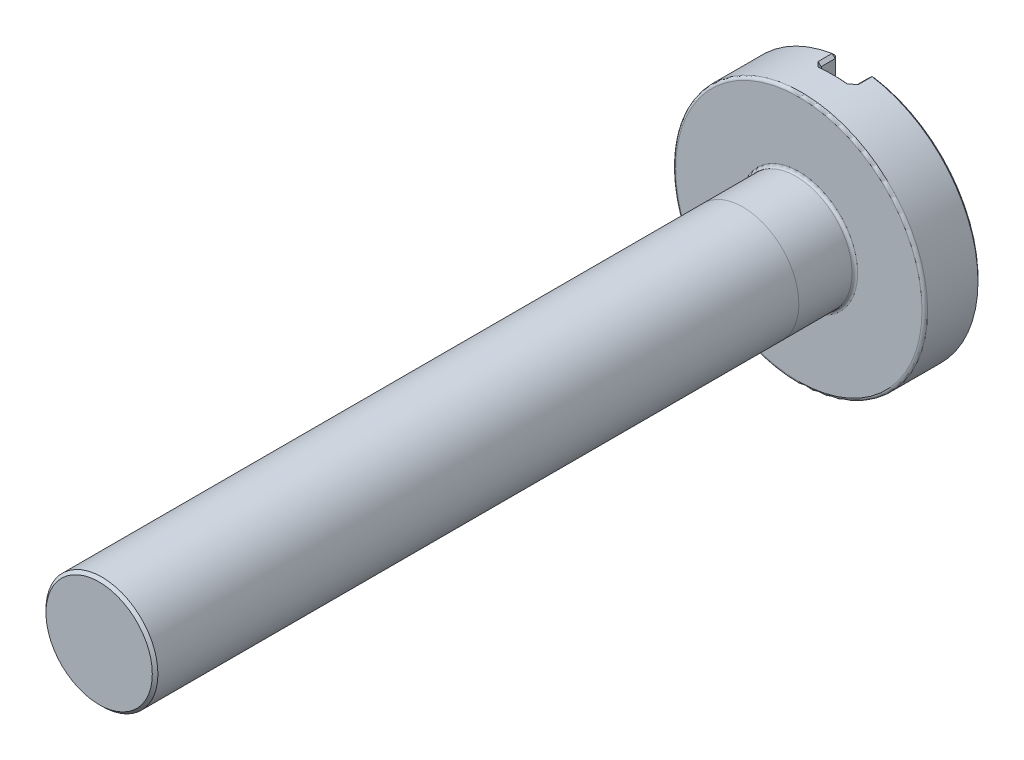
ISO-10303-21;
HEADER;
FILE_DESCRIPTION(('STEP AP214'),'2;1');
FILE_NAME('part.step','',(''),(''),'','','');
FILE_SCHEMA(('AUTOMOTIVE_DESIGN { 1 0 10303 214 1 1 1 1 }'));
ENDSEC;
DATA;
#1=APPLICATION_CONTEXT('core data for automotive mechanical design processes');
#2=APPLICATION_PROTOCOL_DEFINITION('international standard','automotive_design',2000,#1);
#3=PRODUCT_CONTEXT('',#1,'mechanical');
#4=PRODUCT('Part','Part','',(#3));
#5=PRODUCT_RELATED_PRODUCT_CATEGORY('part','',(#4));
#6=PRODUCT_DEFINITION_FORMATION('','',#4);
#7=PRODUCT_DEFINITION_CONTEXT('part definition',#1,'design');
#8=PRODUCT_DEFINITION('design','',#6,#7);
#9=PRODUCT_DEFINITION_SHAPE('','',#8);
#10=(LENGTH_UNIT() NAMED_UNIT(*) SI_UNIT(.MILLI.,.METRE.));
#11=(NAMED_UNIT(*) PLANE_ANGLE_UNIT() SI_UNIT($,.RADIAN.));
#12=(NAMED_UNIT(*) SI_UNIT($,.STERADIAN.) SOLID_ANGLE_UNIT());
#13=UNCERTAINTY_MEASURE_WITH_UNIT(LENGTH_MEASURE(1.E-05),#10,'distance_accuracy_value','');
#14=(GEOMETRIC_REPRESENTATION_CONTEXT(3) GLOBAL_UNCERTAINTY_ASSIGNED_CONTEXT((#13)) GLOBAL_UNIT_ASSIGNED_CONTEXT((#10,
#11,#12)) REPRESENTATION_CONTEXT('',''));
#15=CARTESIAN_POINT('',(0.,0.,0.));
#16=DIRECTION('',(0.,0.,1.));
#17=DIRECTION('',(1.,0.,0.));
#18=AXIS2_PLACEMENT_3D('',#15,#16,#17);
#19=CARTESIAN_POINT('',(0.,0.,12.5));
#20=DIRECTION('',(0.,0.,-1.));
#21=DIRECTION('',(-1.,0.,0.));
#22=AXIS2_PLACEMENT_3D('',#19,#20,#21);
#23=CYLINDRICAL_SURFACE('',#22,1.);
#24=CARTESIAN_POINT('',(0.,0.,12.45));
#25=DIRECTION('',(0.,0.,1.));
#26=DIRECTION('',(1.,0.,0.));
#27=AXIS2_PLACEMENT_3D('',#24,#25,#26);
#28=CIRCLE('',#27,1.);
#29=CARTESIAN_POINT('',(1.,0.,12.45));
#30=VERTEX_POINT('',#29);
#31=EDGE_CURVE('E46',#30,#30,#28,.F.);
#32=ORIENTED_EDGE('',*,*,#31,.T.);
#33=EDGE_LOOP('',(#32));
#34=FACE_BOUND('',#33,.T.);
#35=CARTESIAN_POINT('',(0.,0.,1.));
#36=DIRECTION('',(0.,0.,-1.));
#37=DIRECTION('',(0.,1.,0.));
#38=AXIS2_PLACEMENT_3D('',#35,#36,#37);
#39=CIRCLE('',#38,1.);
#40=CARTESIAN_POINT('',(0.,1.,1.));
#41=VERTEX_POINT('',#40);
#42=EDGE_CURVE('E11',#41,#41,#39,.T.);
#43=ORIENTED_EDGE('',*,*,#42,.F.);
#44=EDGE_LOOP('',(#43));
#45=FACE_BOUND('',#44,.T.);
#46=ADVANCED_FACE('F37',(#34,#45),#23,.T.);
#47=CARTESIAN_POINT('',(0.,0.,-1.));
#48=DIRECTION('',(0.,0.,1.));
#49=DIRECTION('',(1.,0.,0.));
#50=AXIS2_PLACEMENT_3D('',#47,#48,#49);
#51=CYLINDRICAL_SURFACE('',#50,2.25);
#52=CARTESIAN_POINT('',(0.,0.,-0.05));
#53=DIRECTION('',(0.,0.,1.));
#54=DIRECTION('',(1.,0.,0.));
#55=AXIS2_PLACEMENT_3D('',#52,#53,#54);
#56=CIRCLE('',#55,2.25);
#57=CARTESIAN_POINT('',(2.25,0.,-0.05));
#58=VERTEX_POINT('',#57);
#59=EDGE_CURVE('E461',#58,#58,#56,.F.);
#60=ORIENTED_EDGE('',*,*,#59,.T.);
#61=EDGE_LOOP('',(#60));
#62=FACE_BOUND('',#61,.T.);
#63=CARTESIAN_POINT('',(-0.357954545454545,2.22134385978138,-0.7));
#64=CARTESIAN_POINT('',(-0.349044313577281,2.22277959220945,-0.691081725524456));
#65=CARTESIAN_POINT('',(-0.340106008970926,2.22416500607063,-0.682183310951015));
#66=CARTESIAN_POINT('',(-0.322168315908917,2.22683406364462,-0.66443290328283));
#67=CARTESIAN_POINT('',(-0.313168927393423,2.2281177072577,-0.655580910233578));
#68=CARTESIAN_POINT('',(-0.288093679970526,2.2315384498966,-0.631080236997653));
#69=CARTESIAN_POINT('',(-0.271946710820839,2.23356468320811,-0.615488807873462));
#70=CARTESIAN_POINT('',(-0.255681818186013,2.23542541988267,-0.600000000002842));
#71=B_SPLINE_CURVE_WITH_KNOTS('',3,(#63,#64,#65,#66,#67,#68,#69,#70),.UNSPECIFIED.,.F.,.F.,(4,2,
2,4),(0.,0.0380643972705644,0.0761288318363078,0.143736873551843),.UNSPECIFIED.);
#72=CARTESIAN_POINT('',(-0.357954545454545,2.22134385978138,-0.7));
#73=VERTEX_POINT('',#72);
#74=CARTESIAN_POINT('',(-0.255681818181818,2.23542541988124,-0.6));
#75=VERTEX_POINT('',#74);
#76=EDGE_CURVE('E250',#73,#75,#71,.T.);
#77=ORIENTED_EDGE('',*,*,#76,.F.);
#78=DIRECTION('',(0.,0.,1.));
#79=VECTOR('',#78,1.);
#80=CARTESIAN_POINT('',(-0.357954545454545,2.22134385978138,-1.));
#81=LINE('',#80,#79);
#82=CARTESIAN_POINT('',(-0.357954545454545,2.22134385978138,-0.95));
#83=VERTEX_POINT('',#82);
#84=EDGE_CURVE('E248',#73,#83,#81,.F.);
#85=ORIENTED_EDGE('',*,*,#84,.T.);
#86=CARTESIAN_POINT('',(0.,0.,-0.95));
#87=DIRECTION('',(0.,0.,1.));
#88=DIRECTION('',(1.,0.,0.));
#89=AXIS2_PLACEMENT_3D('',#86,#87,#88);
#90=CIRCLE('',#89,2.25);
#91=CARTESIAN_POINT('',(-0.357954545454546,-2.22134385978138,-0.95));
#92=VERTEX_POINT('',#91);
#93=EDGE_CURVE('E243',#83,#92,#90,.T.);
#94=ORIENTED_EDGE('',*,*,#93,.T.);
#95=DIRECTION('',(0.,0.,1.));
#96=VECTOR('',#95,1.);
#97=CARTESIAN_POINT('',(-0.357954545454546,-2.22134385978138,-1.));
#98=LINE('',#97,#96);
#99=CARTESIAN_POINT('',(-0.357954545454546,-2.22134385978138,-0.7));
#100=VERTEX_POINT('',#99);
#101=EDGE_CURVE('E241',#92,#100,#98,.T.);
#102=ORIENTED_EDGE('',*,*,#101,.T.);
#103=CARTESIAN_POINT('',(-0.255681818181819,-2.23542541988124,-0.6));
#104=CARTESIAN_POINT('',(-0.264839427943543,-2.23437790052861,-0.608719796943995));
#105=CARTESIAN_POINT('',(-0.273959417330191,-2.23327784719118,-0.617472569925155));
#106=CARTESIAN_POINT('',(-0.292129371731721,-2.23097387990717,-0.635036917762393));
#107=CARTESIAN_POINT('',(-0.301179336862999,-2.22976996613328,-0.643848492520682));
#108=CARTESIAN_POINT('',(-0.326213414850238,-2.22628523492307,-0.668382417252335));
#109=CARTESIAN_POINT('',(-0.342127740146841,-2.22389382114136,-0.684160444997389));
#110=CARTESIAN_POINT('',(-0.357954545456662,-2.22134385978236,-0.700000000001358));
#111=B_SPLINE_CURVE_WITH_KNOTS('',3,(#103,#104,#105,#106,#107,#108,#109,#110),.UNSPECIFIED.,.F.,
.F.,(4,2,2,4),(0.,0.0380645508803726,0.0761290384749273,0.143736997088426),.UNSPECIFIED.);
#112=CARTESIAN_POINT('',(-0.255681818181819,-2.23542541988124,-0.6));
#113=VERTEX_POINT('',#112);
#114=EDGE_CURVE('E234',#113,#100,#111,.T.);
#115=ORIENTED_EDGE('',*,*,#114,.F.);
#116=CARTESIAN_POINT('',(0.,0.,-0.6));
#117=DIRECTION('',(0.,0.,-1.));
#118=DIRECTION('',(-1.,0.,0.));
#119=AXIS2_PLACEMENT_3D('',#116,#117,#118);
#120=CIRCLE('',#119,2.25);
#121=CARTESIAN_POINT('',(0.255681818181818,-2.23542541988125,-0.6));
#122=VERTEX_POINT('',#121);
#123=EDGE_CURVE('E197',#113,#122,#120,.F.);
#124=ORIENTED_EDGE('',*,*,#123,.T.);
#125=CARTESIAN_POINT('',(0.357954545454544,-2.22134385978138,-0.7));
#126=CARTESIAN_POINT('',(0.34904431357728,-2.22277959220945,-0.691081725524455));
#127=CARTESIAN_POINT('',(0.340106008970925,-2.22416500607064,-0.682183310951015));
#128=CARTESIAN_POINT('',(0.322168315908916,-2.22683406364462,-0.66443290328283));
#129=CARTESIAN_POINT('',(0.313168927393421,-2.2281177072577,-0.655580910233578));
#130=CARTESIAN_POINT('',(0.288093679970524,-2.2315384498966,-0.631080236997653));
#131=CARTESIAN_POINT('',(0.271946710820837,-2.2335646832081,-0.615488807873463));
#132=CARTESIAN_POINT('',(0.255681818186012,-2.23542541988267,-0.600000000002842));
#133=B_SPLINE_CURVE_WITH_KNOTS('',3,(#125,#126,#127,#128,#129,#130,#131,#132),.UNSPECIFIED.,.F.,
.F.,(4,2,2,4),(0.,0.0380643972705647,0.0761288318363081,0.143736873551843),.UNSPECIFIED.);
#134=CARTESIAN_POINT('',(0.357954545454544,-2.22134385978138,-0.7));
#135=VERTEX_POINT('',#134);
#136=EDGE_CURVE('E188',#135,#122,#133,.T.);
#137=ORIENTED_EDGE('',*,*,#136,.F.);
#138=DIRECTION('',(0.,0.,1.));
#139=VECTOR('',#138,1.);
#140=CARTESIAN_POINT('',(0.357954545454544,-2.22134385978138,-1.));
#141=LINE('',#140,#139);
#142=CARTESIAN_POINT('',(0.357954545454544,-2.22134385978138,-0.95));
#143=VERTEX_POINT('',#142);
#144=EDGE_CURVE('E186',#135,#143,#141,.F.);
#145=ORIENTED_EDGE('',*,*,#144,.T.);
#146=CARTESIAN_POINT('',(0.,0.,-0.95));
#147=DIRECTION('',(0.,0.,1.));
#148=DIRECTION('',(1.,0.,0.));
#149=AXIS2_PLACEMENT_3D('',#146,#147,#148);
#150=CIRCLE('',#149,2.25);
#151=CARTESIAN_POINT('',(0.357954545454545,2.22134385978138,-0.95));
#152=VERTEX_POINT('',#151);
#153=EDGE_CURVE('E182',#143,#152,#150,.T.);
#154=ORIENTED_EDGE('',*,*,#153,.T.);
#155=DIRECTION('',(0.,0.,1.));
#156=VECTOR('',#155,1.);
#157=CARTESIAN_POINT('',(0.357954545454545,2.22134385978138,-1.));
#158=LINE('',#157,#156);
#159=CARTESIAN_POINT('',(0.357954545454545,2.22134385978138,-0.7));
#160=VERTEX_POINT('',#159);
#161=EDGE_CURVE('E184',#152,#160,#158,.T.);
#162=ORIENTED_EDGE('',*,*,#161,.T.);
#163=CARTESIAN_POINT('',(0.255681818181818,2.23542541988124,-0.6));
#164=CARTESIAN_POINT('',(0.264839427943543,2.23437790052862,-0.608719796943994));
#165=CARTESIAN_POINT('',(0.273959417330191,2.23327784719118,-0.617472569925155));
#166=CARTESIAN_POINT('',(0.29212937173172,2.23097387990717,-0.635036917762392));
#167=CARTESIAN_POINT('',(0.301179336862998,2.22976996613328,-0.643848492520682));
#168=CARTESIAN_POINT('',(0.326213414850236,2.22628523492307,-0.668382417252336));
#169=CARTESIAN_POINT('',(0.342127740146839,2.22389382114135,-0.68416044499739));
#170=CARTESIAN_POINT('',(0.357954545456661,2.22134385978236,-0.700000000001358));
#171=B_SPLINE_CURVE_WITH_KNOTS('',3,(#163,#164,#165,#166,#167,#168,#169,#170),.UNSPECIFIED.,.F.,
.F.,(4,2,2,4),(0.,0.0380645508803723,0.0761290384749269,0.143736997088426),.UNSPECIFIED.);
#172=CARTESIAN_POINT('',(0.255681818181818,2.23542541988124,-0.6));
#173=VERTEX_POINT('',#172);
#174=EDGE_CURVE('E227',#173,#160,#171,.T.);
#175=ORIENTED_EDGE('',*,*,#174,.F.);
#176=CARTESIAN_POINT('',(0.,0.,-0.6));
#177=DIRECTION('',(0.,0.,-1.));
#178=DIRECTION('',(-1.,0.,0.));
#179=AXIS2_PLACEMENT_3D('',#176,#177,#178);
#180=CIRCLE('',#179,2.25);
#181=EDGE_CURVE('E246',#173,#75,#180,.F.);
#182=ORIENTED_EDGE('',*,*,#181,.T.);
#183=EDGE_LOOP('',(#77,#85,#94,#102,#115,#124,#137,#145,#154,#162,#175,#182));
#184=FACE_BOUND('',#183,.T.);
#185=ADVANCED_FACE('F199',(#62,#184),#51,.T.);
#186=CARTESIAN_POINT('',(0.,0.,-1.));
#187=DIRECTION('',(0.,0.,1.));
#188=DIRECTION('',(1.,0.,0.));
#189=AXIS2_PLACEMENT_3D('',#186,#187,#188);
#190=PLANE('',#189);
#191=CARTESIAN_POINT('',(0.,0.,-1.));
#192=DIRECTION('',(0.,0.,1.));
#193=DIRECTION('',(1.,0.,0.));
#194=AXIS2_PLACEMENT_3D('',#191,#192,#193);
#195=CIRCLE('',#194,2.2);
#196=CARTESIAN_POINT('',(-0.35,-2.17198066289735,-1.));
#197=VERTEX_POINT('',#196);
#198=CARTESIAN_POINT('',(-0.35,2.17198066289735,-1.));
#199=VERTEX_POINT('',#198);
#200=EDGE_CURVE('E165',#197,#199,#195,.F.);
#201=ORIENTED_EDGE('',*,*,#200,.T.);
#202=DIRECTION('',(0.,-1.,0.));
#203=VECTOR('',#202,1.);
#204=CARTESIAN_POINT('',(-0.35,0.,-1.));
#205=LINE('',#204,#203);
#206=EDGE_CURVE('E147',#199,#197,#205,.T.);
#207=ORIENTED_EDGE('',*,*,#206,.T.);
#208=EDGE_LOOP('',(#201,#207));
#209=FACE_BOUND('',#208,.T.);
#210=ADVANCED_FACE('F172',(#209),#190,.F.);
#211=ORIENTED_EDGE('',*,*,#42,.T.);
#212=EDGE_LOOP('',(#211));
#213=FACE_BOUND('',#212,.T.);
#214=CARTESIAN_POINT('',(0.,0.,0.0499999999999997));
#215=DIRECTION('',(0.,0.,1.));
#216=DIRECTION('',(1.,0.,0.));
#217=AXIS2_PLACEMENT_3D('',#214,#215,#216);
#218=CIRCLE('',#217,1.);
#219=CARTESIAN_POINT('',(1.,0.,0.0499999999999997));
#220=VERTEX_POINT('',#219);
#221=EDGE_CURVE('E459',#220,#220,#218,.T.);
#222=ORIENTED_EDGE('',*,*,#221,.T.);
#223=EDGE_LOOP('',(#222));
#224=FACE_BOUND('',#223,.T.);
#225=ADVANCED_FACE('F208',(#213,#224),#23,.T.);
#226=CARTESIAN_POINT('',(0.,0.,12.5));
#227=DIRECTION('',(0.,0.,1.));
#228=DIRECTION('',(1.,0.,0.));
#229=AXIS2_PLACEMENT_3D('',#226,#227,#228);
#230=PLANE('',#229);
#231=CARTESIAN_POINT('',(0.,0.,12.5));
#232=DIRECTION('',(0.,0.,1.));
#233=DIRECTION('',(1.,0.,0.));
#234=AXIS2_PLACEMENT_3D('',#231,#232,#233);
#235=CIRCLE('',#234,0.950000000000003);
#236=CARTESIAN_POINT('',(0.950000000000003,0.,12.5));
#237=VERTEX_POINT('',#236);
#238=EDGE_CURVE('E460',#237,#237,#235,.T.);
#239=ORIENTED_EDGE('',*,*,#238,.T.);
#240=EDGE_LOOP('',(#239));
#241=FACE_BOUND('',#240,.T.);
#242=ADVANCED_FACE('F446',(#241),#230,.T.);
#243=CARTESIAN_POINT('',(0.,0.,-1.));
#244=DIRECTION('',(0.,0.,1.));
#245=DIRECTION('',(1.,0.,0.));
#246=AXIS2_PLACEMENT_3D('',#243,#244,#245);
#247=CIRCLE('',#246,2.2);
#248=CARTESIAN_POINT('',(0.35,2.17198066289735,-1.));
#249=VERTEX_POINT('',#248);
#250=CARTESIAN_POINT('',(0.349999999999999,-2.17198066289735,-1.));
#251=VERTEX_POINT('',#250);
#252=EDGE_CURVE('E52',#249,#251,#247,.F.);
#253=ORIENTED_EDGE('',*,*,#252,.T.);
#254=DIRECTION('',(0.,1.,0.));
#255=VECTOR('',#254,1.);
#256=CARTESIAN_POINT('',(0.349999999999999,0.,-1.));
#257=LINE('',#256,#255);
#258=EDGE_CURVE('E477',#251,#249,#257,.T.);
#259=ORIENTED_EDGE('',*,*,#258,.T.);
#260=EDGE_LOOP('',(#253,#259));
#261=FACE_BOUND('',#260,.T.);
#262=ADVANCED_FACE('F452',(#261),#190,.F.);
#263=CARTESIAN_POINT('',(0.,0.,0.));
#264=DIRECTION('',(0.,0.,1.));
#265=DIRECTION('',(1.,0.,0.));
#266=AXIS2_PLACEMENT_3D('',#263,#264,#265);
#267=PLANE('',#266);
#268=CARTESIAN_POINT('',(0.,0.,0.));
#269=DIRECTION('',(0.,0.,1.));
#270=DIRECTION('',(1.,0.,0.));
#271=AXIS2_PLACEMENT_3D('',#268,#269,#270);
#272=CIRCLE('',#271,2.2);
#273=CARTESIAN_POINT('',(2.2,0.,0.));
#274=VERTEX_POINT('',#273);
#275=EDGE_CURVE('E466',#274,#274,#272,.T.);
#276=ORIENTED_EDGE('',*,*,#275,.T.);
#277=EDGE_LOOP('',(#276));
#278=FACE_BOUND('',#277,.T.);
#279=CARTESIAN_POINT('',(0.,0.,0.));
#280=DIRECTION('',(0.,0.,1.));
#281=DIRECTION('',(1.,0.,0.));
#282=AXIS2_PLACEMENT_3D('',#279,#280,#281);
#283=CIRCLE('',#282,1.05);
#284=CARTESIAN_POINT('',(1.05,0.,0.));
#285=VERTEX_POINT('',#284);
#286=EDGE_CURVE('E474',#285,#285,#283,.F.);
#287=ORIENTED_EDGE('',*,*,#286,.T.);
#288=EDGE_LOOP('',(#287));
#289=FACE_BOUND('',#288,.T.);
#290=ADVANCED_FACE('F604',(#278,#289),#267,.T.);
#291=CARTESIAN_POINT('',(-0.299999999999999,11.0409396780184,-0.65));
#292=DIRECTION('',(-1.,0.,0.));
#293=DIRECTION('',(0.,-1.,0.));
#294=AXIS2_PLACEMENT_3D('',#291,#292,#293);
#295=PLANE('',#294);
#296=DIRECTION('',(0.,0.,-1.));
#297=VECTOR('',#296,1.);
#298=CARTESIAN_POINT('',(-0.300000000000001,-2.17198066289735,-1.));
#299=LINE('',#298,#297);
#300=CARTESIAN_POINT('',(-0.300000000000001,-2.17198066289735,-0.7));
#301=VERTEX_POINT('',#300);
#302=CARTESIAN_POINT('',(-0.300000000000001,-2.17198066289735,-0.95));
#303=VERTEX_POINT('',#302);
#304=EDGE_CURVE('E179',#301,#303,#299,.T.);
#305=ORIENTED_EDGE('',*,*,#304,.T.);
#306=DIRECTION('',(0.,1.,0.));
#307=VECTOR('',#306,1.);
#308=CARTESIAN_POINT('',(-0.299999999999999,11.0409396780184,-0.95));
#309=LINE('',#308,#307);
#310=CARTESIAN_POINT('',(-0.3,2.17198066289735,-0.95));
#311=VERTEX_POINT('',#310);
#312=EDGE_CURVE('E149',#303,#311,#309,.T.);
#313=ORIENTED_EDGE('',*,*,#312,.T.);
#314=DIRECTION('',(0.,0.,1.));
#315=VECTOR('',#314,1.);
#316=CARTESIAN_POINT('',(-0.3,2.17198066289735,-0.65));
#317=LINE('',#316,#315);
#318=CARTESIAN_POINT('',(-0.3,2.17198066289735,-0.7));
#319=VERTEX_POINT('',#318);
#320=EDGE_CURVE('E175',#311,#319,#317,.T.);
#321=ORIENTED_EDGE('',*,*,#320,.T.);
#322=DIRECTION('',(0.,-1.,0.));
#323=VECTOR('',#322,1.);
#324=CARTESIAN_POINT('',(-0.299999999999999,11.0409396780184,-0.7));
#325=LINE('',#324,#323);
#326=EDGE_CURVE('E173',#319,#301,#325,.T.);
#327=ORIENTED_EDGE('',*,*,#326,.T.);
#328=EDGE_LOOP('',(#305,#313,#321,#327));
#329=FACE_BOUND('',#328,.T.);
#330=ADVANCED_FACE('F560',(#329),#295,.F.);
#331=CARTESIAN_POINT('',(0.300000000000001,11.0409396780184,-0.65));
#332=DIRECTION('',(1.,0.,0.));
#333=DIRECTION('',(0.,1.,0.));
#334=AXIS2_PLACEMENT_3D('',#331,#332,#333);
#335=PLANE('',#334);
#336=DIRECTION('',(0.,0.,1.));
#337=VECTOR('',#336,1.);
#338=CARTESIAN_POINT('',(0.299999999999999,-2.17198066289735,-0.65));
#339=LINE('',#338,#337);
#340=CARTESIAN_POINT('',(0.299999999999999,-2.17198066289735,-0.95));
#341=VERTEX_POINT('',#340);
#342=CARTESIAN_POINT('',(0.299999999999999,-2.17198066289735,-0.7));
#343=VERTEX_POINT('',#342);
#344=EDGE_CURVE('E496',#341,#343,#339,.T.);
#345=ORIENTED_EDGE('',*,*,#344,.T.);
#346=DIRECTION('',(0.,1.,0.));
#347=VECTOR('',#346,1.);
#348=CARTESIAN_POINT('',(0.300000000000001,11.0409396780184,-0.7));
#349=LINE('',#348,#347);
#350=CARTESIAN_POINT('',(0.3,2.17198066289735,-0.7));
#351=VERTEX_POINT('',#350);
#352=EDGE_CURVE('E525',#343,#351,#349,.T.);
#353=ORIENTED_EDGE('',*,*,#352,.T.);
#354=DIRECTION('',(0.,0.,-1.));
#355=VECTOR('',#354,1.);
#356=CARTESIAN_POINT('',(0.3,2.17198066289735,-1.));
#357=LINE('',#356,#355);
#358=CARTESIAN_POINT('',(0.3,2.17198066289735,-0.95));
#359=VERTEX_POINT('',#358);
#360=EDGE_CURVE('E520',#351,#359,#357,.T.);
#361=ORIENTED_EDGE('',*,*,#360,.T.);
#362=DIRECTION('',(0.,-1.,0.));
#363=VECTOR('',#362,1.);
#364=CARTESIAN_POINT('',(0.300000000000001,11.0409396780184,-0.95));
#365=LINE('',#364,#363);
#366=EDGE_CURVE('E257',#359,#341,#365,.T.);
#367=ORIENTED_EDGE('',*,*,#366,.T.);
#368=EDGE_LOOP('',(#345,#353,#361,#367));
#369=FACE_BOUND('',#368,.T.);
#370=ADVANCED_FACE('F660',(#369),#335,.F.);
#371=CARTESIAN_POINT('',(0.,0.,-0.65));
#372=DIRECTION('',(0.,0.,-1.));
#373=DIRECTION('',(-1.,0.,0.));
#374=AXIS2_PLACEMENT_3D('',#371,#372,#373);
#375=PLANE('',#374);
#376=DIRECTION('',(0.,-1.,0.));
#377=VECTOR('',#376,1.);
#378=CARTESIAN_POINT('',(0.25,0.,-0.65));
#379=LINE('',#378,#377);
#380=CARTESIAN_POINT('',(0.25,2.18574929943944,-0.65));
#381=VERTEX_POINT('',#380);
#382=CARTESIAN_POINT('',(0.25,-2.18574929943944,-0.65));
#383=VERTEX_POINT('',#382);
#384=EDGE_CURVE('E526',#381,#383,#379,.T.);
#385=ORIENTED_EDGE('',*,*,#384,.T.);
#386=CARTESIAN_POINT('',(0.,0.,-0.65));
#387=DIRECTION('',(0.,0.,-1.));
#388=DIRECTION('',(-1.,0.,0.));
#389=AXIS2_PLACEMENT_3D('',#386,#387,#388);
#390=CIRCLE('',#389,2.2);
#391=CARTESIAN_POINT('',(-0.250000000000001,-2.18574929943944,-0.65));
#392=VERTEX_POINT('',#391);
#393=EDGE_CURVE('E511',#383,#392,#390,.T.);
#394=ORIENTED_EDGE('',*,*,#393,.T.);
#395=DIRECTION('',(0.,1.,0.));
#396=VECTOR('',#395,1.);
#397=CARTESIAN_POINT('',(-0.250000000000001,0.,-0.65));
#398=LINE('',#397,#396);
#399=CARTESIAN_POINT('',(-0.25,2.18574929943944,-0.65));
#400=VERTEX_POINT('',#399);
#401=EDGE_CURVE('E531',#392,#400,#398,.T.);
#402=ORIENTED_EDGE('',*,*,#401,.T.);
#403=CARTESIAN_POINT('',(0.,0.,-0.65));
#404=DIRECTION('',(0.,0.,-1.));
#405=DIRECTION('',(-1.,0.,0.));
#406=AXIS2_PLACEMENT_3D('',#403,#404,#405);
#407=CIRCLE('',#406,2.2);
#408=EDGE_CURVE('E528',#400,#381,#407,.T.);
#409=ORIENTED_EDGE('',*,*,#408,.T.);
#410=EDGE_LOOP('',(#385,#394,#402,#409));
#411=FACE_BOUND('',#410,.T.);
#412=ADVANCED_FACE('F424',(#411),#375,.T.);
#413=CARTESIAN_POINT('',(0.,0.,-0.95));
#414=DIRECTION('',(0.,0.,1.));
#415=DIRECTION('',(1.,0.,0.));
#416=AXIS2_PLACEMENT_3D('',#413,#414,#415);
#417=CONICAL_SURFACE('',#416,2.25,0.785398163397448);
#418=DIRECTION('',(0.112494260643317,-0.698101025154894,0.707106781186548));
#419=VECTOR('',#418,1.);
#420=CARTESIAN_POINT('',(0.,0.,-3.2));
#421=LINE('',#420,#419);
#422=EDGE_CURVE('E480',#251,#143,#421,.T.);
#423=ORIENTED_EDGE('',*,*,#422,.F.);
#424=ORIENTED_EDGE('',*,*,#252,.F.);
#425=DIRECTION('',(-0.112494260643311,-0.698101025154894,-0.707106781186547));
#426=VECTOR('',#425,1.);
#427=CARTESIAN_POINT('',(0.,0.,-3.2));
#428=LINE('',#427,#426);
#429=EDGE_CURVE('E60',#152,#249,#428,.T.);
#430=ORIENTED_EDGE('',*,*,#429,.F.);
#431=ORIENTED_EDGE('',*,*,#153,.F.);
#432=EDGE_LOOP('',(#423,#424,#430,#431));
#433=FACE_BOUND('',#432,.T.);
#434=ADVANCED_FACE('F420',(#433),#417,.T.);
#435=CARTESIAN_POINT('',(0.349999999999999,0.,-1.));
#436=DIRECTION('',(0.707106781186548,0.,0.707106781186548));
#437=DIRECTION('',(0.,1.,0.));
#438=AXIS2_PLACEMENT_3D('',#435,#436,#437);
#439=PLANE('',#438);
#440=DIRECTION('',(0.707106781186548,0.,-0.707106781186548));
#441=VECTOR('',#440,1.);
#442=CARTESIAN_POINT('',(0.3,2.17198066289735,-0.95));
#443=LINE('',#442,#441);
#444=EDGE_CURVE('E170',#249,#359,#443,.F.);
#445=ORIENTED_EDGE('',*,*,#444,.F.);
#446=ORIENTED_EDGE('',*,*,#258,.F.);
#447=DIRECTION('',(-0.707106781186548,0.,0.707106781186548));
#448=VECTOR('',#447,1.);
#449=CARTESIAN_POINT('',(0.328977272727272,-2.17198066289735,-0.978977272727273));
#450=LINE('',#449,#448);
#451=EDGE_CURVE('E483',#341,#251,#450,.F.);
#452=ORIENTED_EDGE('',*,*,#451,.F.);
#453=ORIENTED_EDGE('',*,*,#366,.F.);
#454=EDGE_LOOP('',(#445,#446,#452,#453));
#455=FACE_BOUND('',#454,.T.);
#456=ADVANCED_FACE('F417',(#455),#439,.F.);
#457=CARTESIAN_POINT('',(0.3,2.17198066289735,-0.95));
#458=DIRECTION('',(-0.544058820349415,0.638748776906852,-0.544058820349421));
#459=DIRECTION('',(0.,0.648424664440325,0.761278828383827));
#460=AXIS2_PLACEMENT_3D('',#457,#458,#459);
#461=PLANE('',#460);
#462=ORIENTED_EDGE('',*,*,#429,.T.);
#463=ORIENTED_EDGE('',*,*,#444,.T.);
#464=DIRECTION('',(0.76127882838383,0.648424664440322,0.));
#465=VECTOR('',#464,1.);
#466=CARTESIAN_POINT('',(0.3,2.17198066289735,-0.95));
#467=LINE('',#466,#465);
#468=EDGE_CURVE('E485',#152,#359,#467,.F.);
#469=ORIENTED_EDGE('',*,*,#468,.F.);
#470=EDGE_LOOP('',(#462,#463,#469));
#471=FACE_BOUND('',#470,.T.);
#472=ADVANCED_FACE('F413',(#471),#461,.T.);
#473=CARTESIAN_POINT('',(0.357954545454544,-2.22134385978138,-0.95));
#474=DIRECTION('',(-0.54405882034942,-0.638748776906853,-0.544058820349415));
#475=DIRECTION('',(0.761278828383827,-0.648424664440325,0.));
#476=AXIS2_PLACEMENT_3D('',#473,#474,#475);
#477=PLANE('',#476);
#478=ORIENTED_EDGE('',*,*,#451,.T.);
#479=ORIENTED_EDGE('',*,*,#422,.T.);
#480=DIRECTION('',(0.761278828383827,-0.648424664440325,0.));
#481=VECTOR('',#480,1.);
#482=CARTESIAN_POINT('',(0.357954545454544,-2.22134385978138,-0.95));
#483=LINE('',#482,#481);
#484=EDGE_CURVE('E379',#341,#143,#483,.T.);
#485=ORIENTED_EDGE('',*,*,#484,.F.);
#486=EDGE_LOOP('',(#478,#479,#485));
#487=FACE_BOUND('',#486,.T.);
#488=ADVANCED_FACE('F409',(#487),#477,.T.);
#489=CARTESIAN_POINT('',(0.3,2.17198066289735,-1.));
#490=DIRECTION('',(-0.648424664440321,0.76127882838383,0.));
#491=DIRECTION('',(0.,0.,1.));
#492=AXIS2_PLACEMENT_3D('',#489,#490,#491);
#493=PLANE('',#492);
#494=ORIENTED_EDGE('',*,*,#468,.T.);
#495=ORIENTED_EDGE('',*,*,#360,.F.);
#496=DIRECTION('',(-0.76127882838383,-0.648424664440321,0.));
#497=VECTOR('',#496,1.);
#498=CARTESIAN_POINT('',(0.357954545454545,2.22134385978138,-0.7));
#499=LINE('',#498,#497);
#500=EDGE_CURVE('E380',#160,#351,#499,.T.);
#501=ORIENTED_EDGE('',*,*,#500,.F.);
#502=ORIENTED_EDGE('',*,*,#161,.F.);
#503=EDGE_LOOP('',(#494,#495,#501,#502));
#504=FACE_BOUND('',#503,.T.);
#505=ADVANCED_FACE('F405',(#504),#493,.T.);
#506=CARTESIAN_POINT('',(0.299999999999999,-2.17198066289735,-1.));
#507=DIRECTION('',(0.648424664440325,0.761278828383827,0.));
#508=DIRECTION('',(0.,0.,1.));
#509=AXIS2_PLACEMENT_3D('',#506,#507,#508);
#510=PLANE('',#509);
#511=ORIENTED_EDGE('',*,*,#484,.T.);
#512=ORIENTED_EDGE('',*,*,#144,.F.);
#513=DIRECTION('',(0.761278828383825,-0.648424664440327,0.));
#514=VECTOR('',#513,1.);
#515=CARTESIAN_POINT('',(0.299999999999999,-2.17198066289735,-0.7));
#516=LINE('',#515,#514);
#517=EDGE_CURVE('E507',#343,#135,#516,.T.);
#518=ORIENTED_EDGE('',*,*,#517,.F.);
#519=ORIENTED_EDGE('',*,*,#344,.F.);
#520=EDGE_LOOP('',(#511,#512,#518,#519));
#521=FACE_BOUND('',#520,.T.);
#522=ADVANCED_FACE('F355',(#521),#510,.F.);
#523=CARTESIAN_POINT('',(0.25,0.,-0.65));
#524=DIRECTION('',(0.707106781186548,0.,0.707106781186548));
#525=DIRECTION('',(0.,-1.,0.));
#526=AXIS2_PLACEMENT_3D('',#523,#524,#525);
#527=PLANE('',#526);
#528=CARTESIAN_POINT('',(0.3,2.17198066289735,-0.7));
#529=CARTESIAN_POINT('',(0.295596818382361,2.17319317904379,-0.695596818382361));
#530=CARTESIAN_POINT('',(0.291193636764722,2.17440569519023,-0.691193636764721));
#531=CARTESIAN_POINT('',(0.282387273529443,2.17683072748312,-0.682387273529443));
#532=CARTESIAN_POINT('',(0.277984091911804,2.17804324362956,-0.677984091911804));
#533=CARTESIAN_POINT('',(0.265720606862777,2.18142027299715,-0.665720606862777));
#534=CARTESIAN_POINT('',(0.257860303431388,2.18358478621829,-0.657860303431388));
#535=CARTESIAN_POINT('',(0.25,2.18574929943944,-0.65));
#536=B_SPLINE_CURVE_WITH_KNOTS('',3,(#528,#529,#530,#531,#532,#533,#534,#535),.UNSPECIFIED.,.F.,
.F.,(4,2,2,4),(0.,0.0190319707095955,0.0380639414191911,0.0720387073192473),.UNSPECIFIED.);
#537=EDGE_CURVE('E370',#351,#381,#536,.T.);
#538=ORIENTED_EDGE('',*,*,#537,.F.);
#539=ORIENTED_EDGE('',*,*,#352,.F.);
#540=CARTESIAN_POINT('',(0.25,-2.18574929943944,-0.65));
#541=CARTESIAN_POINT('',(0.254403181617639,-2.184536783293,-0.654403181617639));
#542=CARTESIAN_POINT('',(0.258806363235278,-2.18332426714656,-0.658806363235278));
#543=CARTESIAN_POINT('',(0.267612726470556,-2.18089923485367,-0.667612726470556));
#544=CARTESIAN_POINT('',(0.272015908088195,-2.17968671870723,-0.672015908088195));
#545=CARTESIAN_POINT('',(0.284279393137222,-2.17630968933964,-0.684279393137223));
#546=CARTESIAN_POINT('',(0.292139696568611,-2.17414517611849,-0.692139696568611));
#547=CARTESIAN_POINT('',(0.299999999999999,-2.17198066289735,-0.7));
#548=B_SPLINE_CURVE_WITH_KNOTS('',3,(#540,#541,#542,#543,#544,#545,#546,#547),.UNSPECIFIED.,.F.,
.F.,(4,2,2,4),(0.,0.0190319707095956,0.0380639414191913,0.0720387073192474),.UNSPECIFIED.);
#549=EDGE_CURVE('E363',#383,#343,#548,.T.);
#550=ORIENTED_EDGE('',*,*,#549,.F.);
#551=ORIENTED_EDGE('',*,*,#384,.F.);
#552=EDGE_LOOP('',(#538,#539,#550,#551));
#553=FACE_BOUND('',#552,.T.);
#554=ADVANCED_FACE('F350',(#553),#527,.F.);
#555=CARTESIAN_POINT('',(0.25,2.18574929943944,-0.65));
#556=CARTESIAN_POINT('',(0.3,2.17198066289735,-0.7));
#557=CARTESIAN_POINT('',(0.255681818181818,2.23542541988124,-0.6));
#558=CARTESIAN_POINT('',(0.357954545454545,2.22134385978138,-0.7));
#559=CARTESIAN_POINT('',(0.255780939635302,2.23629203847129,-0.599127731209342));
#560=CARTESIAN_POINT('',(0.35896558428008,2.22220501930236,-0.7));
#561=B_SPLINE_SURFACE_WITH_KNOTS('',1,1,((#555,#556),(#557,#558),(#559,#560)),.UNSPECIFIED.,.F.,
.F.,.F.,(2,1,2),(2,2),(0.,1.,1.01744537581316),(0.,1.),.UNSPECIFIED.);
#562=DIRECTION('',(0.0803530433166526,0.702526432548803,0.70710678118655));
#563=VECTOR('',#562,1.);
#564=CARTESIAN_POINT('',(0.25,2.18574929943944,-0.65));
#565=LINE('',#564,#563);
#566=EDGE_CURVE('E512',#173,#381,#565,.F.);
#567=ORIENTED_EDGE('',*,*,#500,.T.);
#568=ORIENTED_EDGE('',*,*,#537,.T.);
#569=ORIENTED_EDGE('',*,*,#566,.F.);
#570=ORIENTED_EDGE('',*,*,#174,.T.);
#571=EDGE_LOOP('',(#567,#568,#569,#570));
#572=FACE_BOUND('',#571,.T.);
#573=ADVANCED_FACE('F354',(#572),#561,.T.);
#574=CARTESIAN_POINT('',(0.299999999999999,-2.17198066289735,-0.7));
#575=CARTESIAN_POINT('',(0.25,-2.18574929943944,-0.65));
#576=CARTESIAN_POINT('',(0.357954545454544,-2.22134385978138,-0.7));
#577=CARTESIAN_POINT('',(0.255681818181818,-2.23542541988125,-0.6));
#578=CARTESIAN_POINT('',(0.358954514606662,-2.22219559062918,-0.7));
#579=CARTESIAN_POINT('',(0.255779854373202,-2.2362825500278,-0.59913728151582));
#580=B_SPLINE_SURFACE_WITH_KNOTS('',1,1,((#574,#575),(#576,#577),(#578,#579)),.UNSPECIFIED.,.F.,
.F.,.F.,(2,1,2),(2,2),(0.,1.,1.01725436968361),(0.,1.),.UNSPECIFIED.);
#581=DIRECTION('',(-0.080353043316653,0.702526432548807,-0.707106781186547));
#582=VECTOR('',#581,1.);
#583=CARTESIAN_POINT('',(0.255681818181818,-2.23542541988125,-0.6));
#584=LINE('',#583,#582);
#585=EDGE_CURVE('E318',#383,#122,#584,.F.);
#586=ORIENTED_EDGE('',*,*,#517,.T.);
#587=ORIENTED_EDGE('',*,*,#136,.T.);
#588=ORIENTED_EDGE('',*,*,#585,.F.);
#589=ORIENTED_EDGE('',*,*,#549,.T.);
#590=EDGE_LOOP('',(#586,#587,#588,#589));
#591=FACE_BOUND('',#590,.T.);
#592=ADVANCED_FACE('F348',(#591),#580,.T.);
#593=CARTESIAN_POINT('',(0.,0.,-0.6));
#594=DIRECTION('',(0.,0.,1.));
#595=DIRECTION('',(1.,0.,0.));
#596=AXIS2_PLACEMENT_3D('',#593,#594,#595);
#597=CONICAL_SURFACE('',#596,2.25,0.785398163397448);
#598=ORIENTED_EDGE('',*,*,#566,.T.);
#599=ORIENTED_EDGE('',*,*,#408,.F.);
#600=DIRECTION('',(0.0803530433166526,-0.702526432548803,-0.70710678118655));
#601=VECTOR('',#600,1.);
#602=CARTESIAN_POINT('',(-0.255681818181818,2.23542541988124,-0.6));
#603=LINE('',#602,#601);
#604=EDGE_CURVE('E319',#75,#400,#603,.T.);
#605=ORIENTED_EDGE('',*,*,#604,.F.);
#606=ORIENTED_EDGE('',*,*,#181,.F.);
#607=EDGE_LOOP('',(#598,#599,#605,#606));
#608=FACE_BOUND('',#607,.T.);
#609=ADVANCED_FACE('F344',(#608),#597,.T.);
#610=CARTESIAN_POINT('',(0.,0.,-0.6));
#611=DIRECTION('',(0.,0.,1.));
#612=DIRECTION('',(1.,0.,0.));
#613=AXIS2_PLACEMENT_3D('',#610,#611,#612);
#614=CONICAL_SURFACE('',#613,2.25,0.785398163397448);
#615=ORIENTED_EDGE('',*,*,#585,.T.);
#616=ORIENTED_EDGE('',*,*,#123,.F.);
#617=DIRECTION('',(-0.0803530433166538,-0.702526432548806,0.707106781186547));
#618=VECTOR('',#617,1.);
#619=CARTESIAN_POINT('',(-0.250000000000001,-2.18574929943944,-0.65));
#620=LINE('',#619,#618);
#621=EDGE_CURVE('E550',#392,#113,#620,.T.);
#622=ORIENTED_EDGE('',*,*,#621,.F.);
#623=ORIENTED_EDGE('',*,*,#393,.F.);
#624=EDGE_LOOP('',(#615,#616,#622,#623));
#625=FACE_BOUND('',#624,.T.);
#626=ADVANCED_FACE('F293',(#625),#614,.T.);
#627=CARTESIAN_POINT('',(-0.250000000000001,0.,-0.65));
#628=DIRECTION('',(-0.707106781186548,0.,0.707106781186548));
#629=DIRECTION('',(0.,1.,0.));
#630=AXIS2_PLACEMENT_3D('',#627,#628,#629);
#631=PLANE('',#630);
#632=CARTESIAN_POINT('',(-0.25,2.18574929943944,-0.65));
#633=CARTESIAN_POINT('',(-0.254403181617639,2.184536783293,-0.654403181617639));
#634=CARTESIAN_POINT('',(-0.258806363235279,2.18332426714656,-0.658806363235278));
#635=CARTESIAN_POINT('',(-0.267612726470557,2.18089923485367,-0.667612726470556));
#636=CARTESIAN_POINT('',(-0.272015908088196,2.17968671870723,-0.672015908088195));
#637=CARTESIAN_POINT('',(-0.284279393137223,2.17630968933964,-0.684279393137223));
#638=CARTESIAN_POINT('',(-0.292139696568612,2.1741451761185,-0.692139696568611));
#639=CARTESIAN_POINT('',(-0.3,2.17198066289735,-0.7));
#640=B_SPLINE_CURVE_WITH_KNOTS('',3,(#632,#633,#634,#635,#636,#637,#638,#639),.UNSPECIFIED.,.F.,
.F.,(4,2,2,4),(0.,0.0190319707095957,0.0380639414191912,0.0720387073192474),.UNSPECIFIED.);
#641=EDGE_CURVE('E309',#400,#319,#640,.T.);
#642=ORIENTED_EDGE('',*,*,#641,.F.);
#643=ORIENTED_EDGE('',*,*,#401,.F.);
#644=CARTESIAN_POINT('',(-0.300000000000001,-2.17198066289735,-0.7));
#645=CARTESIAN_POINT('',(-0.295596818382362,-2.17319317904379,-0.695596818382361));
#646=CARTESIAN_POINT('',(-0.291193636764722,-2.17440569519023,-0.691193636764721));
#647=CARTESIAN_POINT('',(-0.282387273529444,-2.17683072748312,-0.682387273529443));
#648=CARTESIAN_POINT('',(-0.277984091911805,-2.17804324362956,-0.677984091911804));
#649=CARTESIAN_POINT('',(-0.265720606862778,-2.18142027299715,-0.665720606862777));
#650=CARTESIAN_POINT('',(-0.257860303431389,-2.18358478621829,-0.657860303431388));
#651=CARTESIAN_POINT('',(-0.250000000000001,-2.18574929943944,-0.65));
#652=B_SPLINE_CURVE_WITH_KNOTS('',3,(#644,#645,#646,#647,#648,#649,#650,#651),.UNSPECIFIED.,.F.,
.F.,(4,2,2,4),(0.,0.0190319707095956,0.0380639414191913,0.0720387073192473),.UNSPECIFIED.);
#653=EDGE_CURVE('E301',#301,#392,#652,.T.);
#654=ORIENTED_EDGE('',*,*,#653,.F.);
#655=ORIENTED_EDGE('',*,*,#326,.F.);
#656=EDGE_LOOP('',(#642,#643,#654,#655));
#657=FACE_BOUND('',#656,.T.);
#658=ADVANCED_FACE('F288',(#657),#631,.F.);
#659=CARTESIAN_POINT('',(-0.3,2.17198066289735,-0.7));
#660=CARTESIAN_POINT('',(-0.25,2.18574929943944,-0.65));
#661=CARTESIAN_POINT('',(-0.357954545454545,2.22134385978138,-0.7));
#662=CARTESIAN_POINT('',(-0.255681818181818,2.23542541988124,-0.6));
#663=CARTESIAN_POINT('',(-0.358954514606665,2.22219559062918,-0.7));
#664=CARTESIAN_POINT('',(-0.255779854373203,2.2362825500278,-0.599137281515819));
#665=B_SPLINE_SURFACE_WITH_KNOTS('',1,1,((#659,#660),(#661,#662),(#663,#664)),.UNSPECIFIED.,.F.,
.F.,.F.,(2,1,2),(2,2),(0.,1.,1.01725436968363),(0.,1.),.UNSPECIFIED.);
#666=DIRECTION('',(-0.761278828383827,0.648424664440325,0.));
#667=VECTOR('',#666,1.);
#668=CARTESIAN_POINT('',(-0.3,2.17198066289735,-0.7));
#669=LINE('',#668,#667);
#670=EDGE_CURVE('E545',#73,#319,#669,.F.);
#671=ORIENTED_EDGE('',*,*,#604,.T.);
#672=ORIENTED_EDGE('',*,*,#641,.T.);
#673=ORIENTED_EDGE('',*,*,#670,.F.);
#674=ORIENTED_EDGE('',*,*,#76,.T.);
#675=EDGE_LOOP('',(#671,#672,#673,#674));
#676=FACE_BOUND('',#675,.T.);
#677=ADVANCED_FACE('F292',(#676),#665,.T.);
#678=CARTESIAN_POINT('',(-0.250000000000001,-2.18574929943944,-0.65));
#679=CARTESIAN_POINT('',(-0.300000000000001,-2.17198066289735,-0.7));
#680=CARTESIAN_POINT('',(-0.255681818181819,-2.23542541988124,-0.6));
#681=CARTESIAN_POINT('',(-0.357954545454546,-2.22134385978138,-0.7));
#682=CARTESIAN_POINT('',(-0.255780939635303,-2.23629203847129,-0.599127731209342));
#683=CARTESIAN_POINT('',(-0.358965584280082,-2.22220501930236,-0.7));
#684=B_SPLINE_SURFACE_WITH_KNOTS('',1,1,((#678,#679),(#680,#681),(#682,#683)),.UNSPECIFIED.,.F.,
.F.,.F.,(2,1,2),(2,2),(0.,1.,1.01744537581317),(0.,1.),.UNSPECIFIED.);
#685=DIRECTION('',(0.761278828383827,0.648424664440325,0.));
#686=VECTOR('',#685,1.);
#687=CARTESIAN_POINT('',(-0.357954545454546,-2.22134385978138,-0.7));
#688=LINE('',#687,#686);
#689=EDGE_CURVE('E543',#301,#100,#688,.F.);
#690=ORIENTED_EDGE('',*,*,#621,.T.);
#691=ORIENTED_EDGE('',*,*,#114,.T.);
#692=ORIENTED_EDGE('',*,*,#689,.F.);
#693=ORIENTED_EDGE('',*,*,#653,.T.);
#694=EDGE_LOOP('',(#690,#691,#692,#693));
#695=FACE_BOUND('',#694,.T.);
#696=ADVANCED_FACE('F286',(#695),#684,.T.);
#697=CARTESIAN_POINT('',(-0.3,2.17198066289735,-1.));
#698=DIRECTION('',(-0.648424664440325,-0.761278828383827,0.));
#699=DIRECTION('',(0.,0.,1.));
#700=AXIS2_PLACEMENT_3D('',#697,#698,#699);
#701=PLANE('',#700);
#702=ORIENTED_EDGE('',*,*,#670,.T.);
#703=ORIENTED_EDGE('',*,*,#320,.F.);
#704=DIRECTION('',(-0.761278828383827,0.648424664440324,0.));
#705=VECTOR('',#704,1.);
#706=CARTESIAN_POINT('',(-0.3,2.17198066289735,-0.95));
#707=LINE('',#706,#705);
#708=EDGE_CURVE('E540',#83,#311,#707,.F.);
#709=ORIENTED_EDGE('',*,*,#708,.F.);
#710=ORIENTED_EDGE('',*,*,#84,.F.);
#711=EDGE_LOOP('',(#702,#703,#709,#710));
#712=FACE_BOUND('',#711,.T.);
#713=ADVANCED_FACE('F283',(#712),#701,.F.);
#714=CARTESIAN_POINT('',(0.,0.,-0.95));
#715=DIRECTION('',(0.,0.,1.));
#716=DIRECTION('',(1.,0.,0.));
#717=AXIS2_PLACEMENT_3D('',#714,#715,#716);
#718=CONICAL_SURFACE('',#717,2.25,0.785398163397448);
#719=DIRECTION('',(0.112494260643311,0.698101025154894,-0.707106781186548));
#720=VECTOR('',#719,1.);
#721=CARTESIAN_POINT('',(0.,0.,-3.2));
#722=LINE('',#721,#720);
#723=EDGE_CURVE('E154',#92,#197,#722,.T.);
#724=ORIENTED_EDGE('',*,*,#723,.F.);
#725=ORIENTED_EDGE('',*,*,#93,.F.);
#726=DIRECTION('',(-0.112494260643311,0.698101025154894,0.707106781186548));
#727=VECTOR('',#726,1.);
#728=CARTESIAN_POINT('',(0.,0.,-3.2));
#729=LINE('',#728,#727);
#730=EDGE_CURVE('E162',#199,#83,#729,.T.);
#731=ORIENTED_EDGE('',*,*,#730,.F.);
#732=ORIENTED_EDGE('',*,*,#200,.F.);
#733=EDGE_LOOP('',(#724,#725,#731,#732));
#734=FACE_BOUND('',#733,.T.);
#735=ADVANCED_FACE('F166',(#734),#718,.T.);
#736=CARTESIAN_POINT('',(-0.300000000000001,-2.17198066289735,-1.));
#737=DIRECTION('',(0.648424664440325,-0.761278828383827,0.));
#738=DIRECTION('',(0.,0.,1.));
#739=AXIS2_PLACEMENT_3D('',#736,#737,#738);
#740=PLANE('',#739);
#741=ORIENTED_EDGE('',*,*,#689,.T.);
#742=ORIENTED_EDGE('',*,*,#101,.F.);
#743=DIRECTION('',(-0.761278828383827,-0.648424664440324,0.));
#744=VECTOR('',#743,1.);
#745=CARTESIAN_POINT('',(-0.328977272727273,-2.19666226133936,-0.95));
#746=LINE('',#745,#744);
#747=EDGE_CURVE('E158',#303,#92,#746,.T.);
#748=ORIENTED_EDGE('',*,*,#747,.F.);
#749=ORIENTED_EDGE('',*,*,#304,.F.);
#750=EDGE_LOOP('',(#741,#742,#748,#749));
#751=FACE_BOUND('',#750,.T.);
#752=ADVANCED_FACE('F276',(#751),#740,.T.);
#753=CARTESIAN_POINT('',(-0.3,2.17198066289735,-0.95));
#754=DIRECTION('',(0.544058820349419,0.638748776906851,-0.544058820349419));
#755=DIRECTION('',(0.,0.648424664440325,0.761278828383827));
#756=AXIS2_PLACEMENT_3D('',#753,#754,#755);
#757=PLANE('',#756);
#758=ORIENTED_EDGE('',*,*,#730,.T.);
#759=ORIENTED_EDGE('',*,*,#708,.T.);
#760=DIRECTION('',(0.707106781186547,0.,0.707106781186547));
#761=VECTOR('',#760,1.);
#762=CARTESIAN_POINT('',(-0.3,2.17198066289735,-0.95));
#763=LINE('',#762,#761);
#764=EDGE_CURVE('E151',#199,#311,#763,.T.);
#765=ORIENTED_EDGE('',*,*,#764,.F.);
#766=EDGE_LOOP('',(#758,#759,#765));
#767=FACE_BOUND('',#766,.T.);
#768=ADVANCED_FACE('F273',(#767),#757,.T.);
#769=CARTESIAN_POINT('',(-0.35,-2.17198066289735,-1.));
#770=DIRECTION('',(0.544058820349419,-0.638748776906851,-0.544058820349419));
#771=DIRECTION('',(0.,0.648424664440325,-0.761278828383827));
#772=AXIS2_PLACEMENT_3D('',#769,#770,#771);
#773=PLANE('',#772);
#774=ORIENTED_EDGE('',*,*,#747,.T.);
#775=ORIENTED_EDGE('',*,*,#723,.T.);
#776=DIRECTION('',(-0.707106781186547,0.,-0.707106781186547));
#777=VECTOR('',#776,1.);
#778=CARTESIAN_POINT('',(-0.35,-2.17198066289735,-1.));
#779=LINE('',#778,#777);
#780=EDGE_CURVE('E143',#303,#197,#779,.T.);
#781=ORIENTED_EDGE('',*,*,#780,.F.);
#782=EDGE_LOOP('',(#774,#775,#781));
#783=FACE_BOUND('',#782,.T.);
#784=ADVANCED_FACE('F156',(#783),#773,.T.);
#785=CARTESIAN_POINT('',(-0.35,0.,-1.));
#786=DIRECTION('',(-0.707106781186548,0.,0.707106781186548));
#787=DIRECTION('',(0.,-1.,0.));
#788=AXIS2_PLACEMENT_3D('',#785,#786,#787);
#789=PLANE('',#788);
#790=ORIENTED_EDGE('',*,*,#764,.T.);
#791=ORIENTED_EDGE('',*,*,#312,.F.);
#792=ORIENTED_EDGE('',*,*,#780,.T.);
#793=ORIENTED_EDGE('',*,*,#206,.F.);
#794=EDGE_LOOP('',(#790,#791,#792,#793));
#795=FACE_BOUND('',#794,.T.);
#796=ADVANCED_FACE('F145',(#795),#789,.F.);
#797=CARTESIAN_POINT('',(0.,0.,-0.05));
#798=DIRECTION('',(0.,0.,1.));
#799=DIRECTION('',(1.,0.,0.));
#800=AXIS2_PLACEMENT_3D('',#797,#798,#799);
#801=TOROIDAL_SURFACE('',#800,2.2,0.05);
#802=ORIENTED_EDGE('',*,*,#59,.F.);
#803=EDGE_LOOP('',(#802));
#804=FACE_BOUND('',#803,.T.);
#805=ORIENTED_EDGE('',*,*,#275,.F.);
#806=EDGE_LOOP('',(#805));
#807=FACE_BOUND('',#806,.T.);
#808=ADVANCED_FACE('F270',(#804,#807),#801,.T.);
#809=CARTESIAN_POINT('',(0.,0.,0.0499999999999997));
#810=DIRECTION('',(0.,0.,1.));
#811=DIRECTION('',(1.,0.,0.));
#812=AXIS2_PLACEMENT_3D('',#809,#810,#811);
#813=TOROIDAL_SURFACE('',#812,1.05,0.05);
#814=ORIENTED_EDGE('',*,*,#286,.F.);
#815=EDGE_LOOP('',(#814));
#816=FACE_BOUND('',#815,.T.);
#817=ORIENTED_EDGE('',*,*,#221,.F.);
#818=EDGE_LOOP('',(#817));
#819=FACE_BOUND('',#818,.T.);
#820=ADVANCED_FACE('F427',(#816,#819),#813,.F.);
#821=CARTESIAN_POINT('',(0.,0.,12.5));
#822=DIRECTION('',(0.,0.,-1.));
#823=DIRECTION('',(-1.,0.,0.));
#824=AXIS2_PLACEMENT_3D('',#821,#822,#823);
#825=CONICAL_SURFACE('',#824,0.950000000000003,0.78539816339744);
#826=ORIENTED_EDGE('',*,*,#31,.F.);
#827=EDGE_LOOP('',(#826));
#828=FACE_BOUND('',#827,.T.);
#829=ORIENTED_EDGE('',*,*,#238,.F.);
#830=EDGE_LOOP('',(#829));
#831=FACE_BOUND('',#830,.T.);
#832=ADVANCED_FACE('F39',(#828,#831),#825,.T.);
#833=CLOSED_SHELL('',(#46,#185,#210,#225,#242,#262,#290,#330,#370,#412,#434,#456,#472,#488,#505,
#522,#554,#573,#592,#609,#626,#658,#677,#696,#713,#735,#752,#768,#784,#796,#808,#820,#832));
#834=MANIFOLD_SOLID_BREP('B2',#833);
#835=ADVANCED_BREP_SHAPE_REPRESENTATION('',(#18,#834),#14);
#836=SHAPE_DEFINITION_REPRESENTATION(#9,#835);
ENDSEC;
END-ISO-10303-21;
